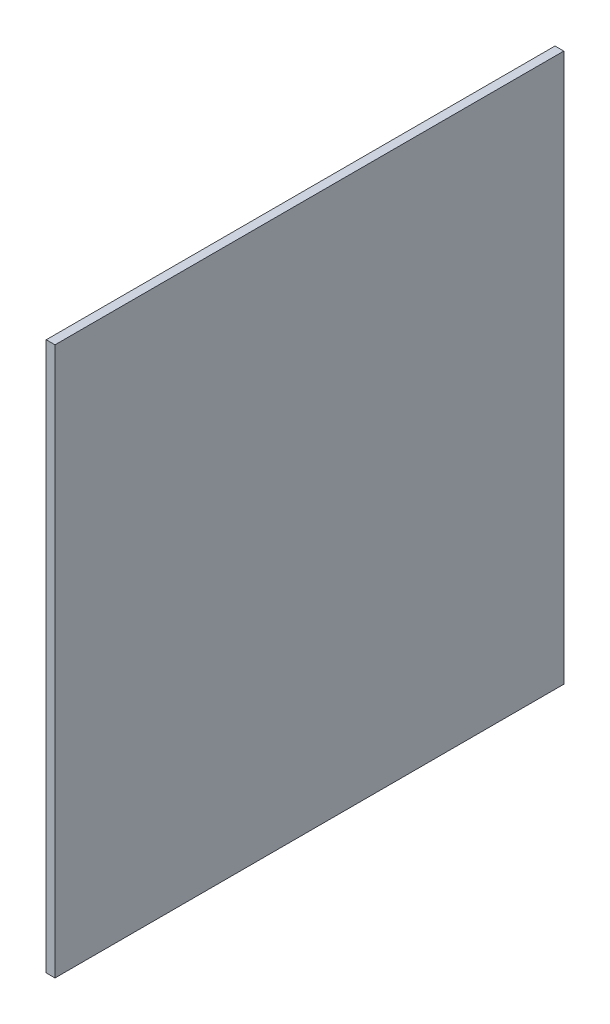
ISO-10303-21;
HEADER;
FILE_DESCRIPTION(('STEP AP214'),'2;1');
FILE_NAME('part.step','',(''),(''),'','','');
FILE_SCHEMA(('AUTOMOTIVE_DESIGN { 1 0 10303 214 1 1 1 1 }'));
ENDSEC;
DATA;
#1=APPLICATION_CONTEXT('core data for automotive mechanical design processes');
#2=APPLICATION_PROTOCOL_DEFINITION('international standard','automotive_design',2000,#1);
#3=PRODUCT_CONTEXT('',#1,'mechanical');
#4=PRODUCT('Part','Part','',(#3));
#5=PRODUCT_RELATED_PRODUCT_CATEGORY('part','',(#4));
#6=PRODUCT_DEFINITION_FORMATION('','',#4);
#7=PRODUCT_DEFINITION_CONTEXT('part definition',#1,'design');
#8=PRODUCT_DEFINITION('design','',#6,#7);
#9=PRODUCT_DEFINITION_SHAPE('','',#8);
#10=(LENGTH_UNIT() NAMED_UNIT(*) SI_UNIT(.MILLI.,.METRE.));
#11=(NAMED_UNIT(*) PLANE_ANGLE_UNIT() SI_UNIT($,.RADIAN.));
#12=(NAMED_UNIT(*) SI_UNIT($,.STERADIAN.) SOLID_ANGLE_UNIT());
#13=UNCERTAINTY_MEASURE_WITH_UNIT(LENGTH_MEASURE(1.E-05),#10,'distance_accuracy_value','');
#14=(GEOMETRIC_REPRESENTATION_CONTEXT(3) GLOBAL_UNCERTAINTY_ASSIGNED_CONTEXT((#13)) GLOBAL_UNIT_ASSIGNED_CONTEXT((#10,
#11,#12)) REPRESENTATION_CONTEXT('',''));
#15=CARTESIAN_POINT('',(0.,0.,0.));
#16=DIRECTION('',(0.,0.,1.));
#17=DIRECTION('',(1.,0.,0.));
#18=AXIS2_PLACEMENT_3D('',#15,#16,#17);
#19=CARTESIAN_POINT('',(2.032,2.032,-122.4));
#20=DIRECTION('',(0.,0.,1.));
#21=DIRECTION('',(1.,0.,0.));
#22=AXIS2_PLACEMENT_3D('',#19,#20,#21);
#23=PLANE('',#22);
#24=DIRECTION('',(0.,1.,0.));
#25=VECTOR('',#24,1.);
#26=CARTESIAN_POINT('',(0.,2.032,-122.4));
#27=LINE('',#26,#25);
#28=CARTESIAN_POINT('',(0.,2.032,-122.4));
#29=VERTEX_POINT('',#28);
#30=CARTESIAN_POINT('',(0.,129.032,-122.4));
#31=VERTEX_POINT('',#30);
#32=EDGE_CURVE('E96',#29,#31,#27,.T.);
#33=ORIENTED_EDGE('',*,*,#32,.T.);
#34=DIRECTION('',(-1.,0.,0.));
#35=VECTOR('',#34,1.);
#36=CARTESIAN_POINT('',(2.032,129.032,-122.4));
#37=LINE('',#36,#35);
#38=CARTESIAN_POINT('',(2.032,129.032,-122.4));
#39=VERTEX_POINT('',#38);
#40=EDGE_CURVE('E11',#39,#31,#37,.T.);
#41=ORIENTED_EDGE('',*,*,#40,.F.);
#42=DIRECTION('',(0.,1.,0.));
#43=VECTOR('',#42,1.);
#44=CARTESIAN_POINT('',(2.032,2.032,-122.4));
#45=LINE('',#44,#43);
#46=CARTESIAN_POINT('',(2.032,2.032,-122.4));
#47=VERTEX_POINT('',#46);
#48=EDGE_CURVE('E84',#47,#39,#45,.T.);
#49=ORIENTED_EDGE('',*,*,#48,.F.);
#50=DIRECTION('',(-1.,0.,0.));
#51=VECTOR('',#50,1.);
#52=CARTESIAN_POINT('',(2.032,2.032,-122.4));
#53=LINE('',#52,#51);
#54=EDGE_CURVE('E92',#47,#29,#53,.T.);
#55=ORIENTED_EDGE('',*,*,#54,.T.);
#56=EDGE_LOOP('',(#33,#41,#49,#55));
#57=FACE_BOUND('',#56,.T.);
#58=ADVANCED_FACE('F33',(#57),#23,.F.);
#59=CARTESIAN_POINT('',(2.032,129.032,-122.4));
#60=DIRECTION('',(0.,-1.,0.));
#61=DIRECTION('',(0.,0.,-1.));
#62=AXIS2_PLACEMENT_3D('',#59,#60,#61);
#63=PLANE('',#62);
#64=DIRECTION('',(0.,0.,1.));
#65=VECTOR('',#64,1.);
#66=CARTESIAN_POINT('',(0.,129.032,-122.4));
#67=LINE('',#66,#65);
#68=CARTESIAN_POINT('',(0.,129.032,-4.57200000000001));
#69=VERTEX_POINT('',#68);
#70=EDGE_CURVE('E88',#31,#69,#67,.T.);
#71=ORIENTED_EDGE('',*,*,#70,.T.);
#72=DIRECTION('',(-1.,0.,0.));
#73=VECTOR('',#72,1.);
#74=CARTESIAN_POINT('',(2.032,129.032,-4.57200000000001));
#75=LINE('',#74,#73);
#76=CARTESIAN_POINT('',(2.032,129.032,-4.57200000000001));
#77=VERTEX_POINT('',#76);
#78=EDGE_CURVE('E41',#77,#69,#75,.T.);
#79=ORIENTED_EDGE('',*,*,#78,.F.);
#80=DIRECTION('',(0.,0.,1.));
#81=VECTOR('',#80,1.);
#82=CARTESIAN_POINT('',(2.032,129.032,-122.4));
#83=LINE('',#82,#81);
#84=EDGE_CURVE('E79',#39,#77,#83,.T.);
#85=ORIENTED_EDGE('',*,*,#84,.F.);
#86=ORIENTED_EDGE('',*,*,#40,.T.);
#87=EDGE_LOOP('',(#71,#79,#85,#86));
#88=FACE_BOUND('',#87,.T.);
#89=ADVANCED_FACE('F87',(#88),#63,.F.);
#90=CARTESIAN_POINT('',(2.032,2.03199999999999,-4.57200000000001));
#91=DIRECTION('',(0.,0.,-1.));
#92=DIRECTION('',(-1.,0.,0.));
#93=AXIS2_PLACEMENT_3D('',#90,#91,#92);
#94=PLANE('',#93);
#95=DIRECTION('',(0.,-1.,0.));
#96=VECTOR('',#95,1.);
#97=CARTESIAN_POINT('',(0.,2.03199999999999,-4.57200000000001));
#98=LINE('',#97,#96);
#99=CARTESIAN_POINT('',(0.,2.03199999999999,-4.57200000000001));
#100=VERTEX_POINT('',#99);
#101=EDGE_CURVE('E66',#69,#100,#98,.T.);
#102=ORIENTED_EDGE('',*,*,#101,.T.);
#103=DIRECTION('',(-1.,0.,0.));
#104=VECTOR('',#103,1.);
#105=CARTESIAN_POINT('',(2.032,2.03199999999999,-4.57200000000001));
#106=LINE('',#105,#104);
#107=CARTESIAN_POINT('',(2.032,2.03199999999999,-4.57200000000001));
#108=VERTEX_POINT('',#107);
#109=EDGE_CURVE('E89',#108,#100,#106,.T.);
#110=ORIENTED_EDGE('',*,*,#109,.F.);
#111=DIRECTION('',(0.,-1.,0.));
#112=VECTOR('',#111,1.);
#113=CARTESIAN_POINT('',(2.032,2.03199999999999,-4.57200000000001));
#114=LINE('',#113,#112);
#115=EDGE_CURVE('E82',#77,#108,#114,.T.);
#116=ORIENTED_EDGE('',*,*,#115,.F.);
#117=ORIENTED_EDGE('',*,*,#78,.T.);
#118=EDGE_LOOP('',(#102,#110,#116,#117));
#119=FACE_BOUND('',#118,.T.);
#120=ADVANCED_FACE('F90',(#119),#94,.F.);
#121=CARTESIAN_POINT('',(2.032,2.032,-122.4));
#122=DIRECTION('',(0.,1.,0.));
#123=DIRECTION('',(0.,0.,1.));
#124=AXIS2_PLACEMENT_3D('',#121,#122,#123);
#125=PLANE('',#124);
#126=DIRECTION('',(0.,0.,-1.));
#127=VECTOR('',#126,1.);
#128=CARTESIAN_POINT('',(0.,2.032,-122.4));
#129=LINE('',#128,#127);
#130=EDGE_CURVE('E72',#100,#29,#129,.T.);
#131=ORIENTED_EDGE('',*,*,#130,.T.);
#132=ORIENTED_EDGE('',*,*,#54,.F.);
#133=DIRECTION('',(0.,0.,-1.));
#134=VECTOR('',#133,1.);
#135=CARTESIAN_POINT('',(2.032,2.032,-122.4));
#136=LINE('',#135,#134);
#137=EDGE_CURVE('E49',#108,#47,#136,.T.);
#138=ORIENTED_EDGE('',*,*,#137,.F.);
#139=ORIENTED_EDGE('',*,*,#109,.T.);
#140=EDGE_LOOP('',(#131,#132,#138,#139));
#141=FACE_BOUND('',#140,.T.);
#142=ADVANCED_FACE('F103',(#141),#125,.F.);
#143=CARTESIAN_POINT('',(2.032,0.,0.));
#144=DIRECTION('',(1.,0.,0.));
#145=DIRECTION('',(0.,0.,-1.));
#146=AXIS2_PLACEMENT_3D('',#143,#144,#145);
#147=PLANE('',#146);
#148=ORIENTED_EDGE('',*,*,#48,.T.);
#149=ORIENTED_EDGE('',*,*,#84,.T.);
#150=ORIENTED_EDGE('',*,*,#115,.T.);
#151=ORIENTED_EDGE('',*,*,#137,.T.);
#152=EDGE_LOOP('',(#148,#149,#150,#151));
#153=FACE_BOUND('',#152,.T.);
#154=ADVANCED_FACE('F80',(#153),#147,.T.);
#155=CARTESIAN_POINT('',(0.,0.,0.));
#156=DIRECTION('',(1.,0.,0.));
#157=DIRECTION('',(0.,0.,-1.));
#158=AXIS2_PLACEMENT_3D('',#155,#156,#157);
#159=PLANE('',#158);
#160=ORIENTED_EDGE('',*,*,#32,.F.);
#161=ORIENTED_EDGE('',*,*,#130,.F.);
#162=ORIENTED_EDGE('',*,*,#101,.F.);
#163=ORIENTED_EDGE('',*,*,#70,.F.);
#164=EDGE_LOOP('',(#160,#161,#162,#163));
#165=FACE_BOUND('',#164,.T.);
#166=ADVANCED_FACE('F106',(#165),#159,.F.);
#167=CLOSED_SHELL('',(#58,#89,#120,#142,#154,#166));
#168=MANIFOLD_SOLID_BREP('B2',#167);
#169=ADVANCED_BREP_SHAPE_REPRESENTATION('',(#18,#168),#14);
#170=SHAPE_DEFINITION_REPRESENTATION(#9,#169);
ENDSEC;
END-ISO-10303-21;
